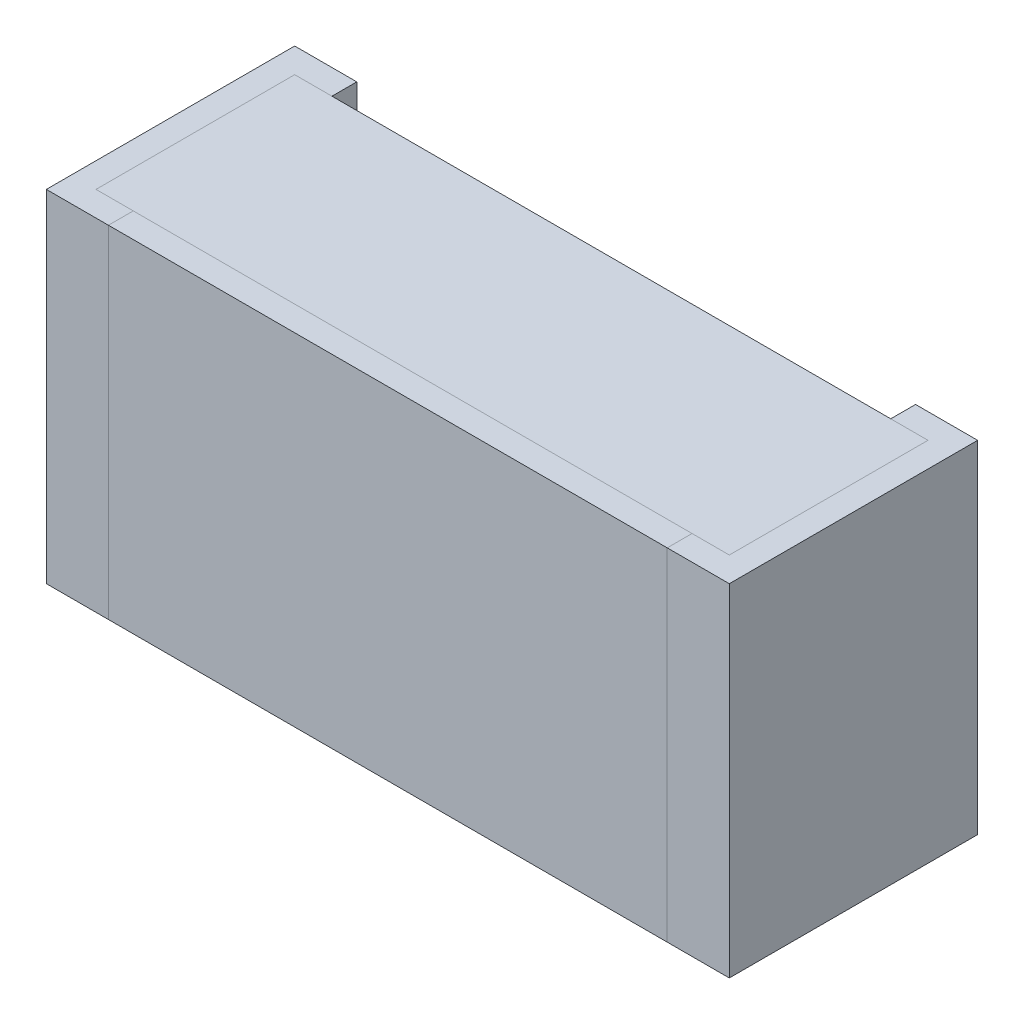
ISO-10303-21;
HEADER;
FILE_DESCRIPTION(('STEP AP214'),'2;1');
FILE_NAME('part.step','',(''),(''),'','','');
FILE_SCHEMA(('AUTOMOTIVE_DESIGN { 1 0 10303 214 1 1 1 1 }'));
ENDSEC;
DATA;
#1=APPLICATION_CONTEXT('core data for automotive mechanical design processes');
#2=APPLICATION_PROTOCOL_DEFINITION('international standard','automotive_design',2000,#1);
#3=PRODUCT_CONTEXT('',#1,'mechanical');
#4=PRODUCT('Part','Part','',(#3));
#5=PRODUCT_RELATED_PRODUCT_CATEGORY('part','',(#4));
#6=PRODUCT_DEFINITION_FORMATION('','',#4);
#7=PRODUCT_DEFINITION_CONTEXT('part definition',#1,'design');
#8=PRODUCT_DEFINITION('design','',#6,#7);
#9=PRODUCT_DEFINITION_SHAPE('','',#8);
#10=(LENGTH_UNIT() NAMED_UNIT(*) SI_UNIT(.MILLI.,.METRE.));
#11=(NAMED_UNIT(*) PLANE_ANGLE_UNIT() SI_UNIT($,.RADIAN.));
#12=(NAMED_UNIT(*) SI_UNIT($,.STERADIAN.) SOLID_ANGLE_UNIT());
#13=UNCERTAINTY_MEASURE_WITH_UNIT(LENGTH_MEASURE(1.E-05),#10,'distance_accuracy_value','');
#14=(GEOMETRIC_REPRESENTATION_CONTEXT(3) GLOBAL_UNCERTAINTY_ASSIGNED_CONTEXT((#13)) GLOBAL_UNIT_ASSIGNED_CONTEXT((#10,
#11,#12)) REPRESENTATION_CONTEXT('',''));
#15=CARTESIAN_POINT('',(0.,0.,0.));
#16=DIRECTION('',(0.,0.,1.));
#17=DIRECTION('',(1.,0.,0.));
#18=AXIS2_PLACEMENT_3D('',#15,#16,#17);
#19=CARTESIAN_POINT('',(-0.51,-0.275,0.04));
#20=DIRECTION('',(1.,0.,0.));
#21=DIRECTION('',(0.,0.,1.));
#22=AXIS2_PLACEMENT_3D('',#19,#20,#21);
#23=PLANE('',#22);
#24=DIRECTION('',(0.,1.,0.));
#25=VECTOR('',#24,1.);
#26=CARTESIAN_POINT('',(-0.51,-0.275,0.36));
#27=LINE('',#26,#25);
#28=CARTESIAN_POINT('',(-0.51,-0.275,0.36));
#29=VERTEX_POINT('',#28);
#30=CARTESIAN_POINT('',(-0.51,0.275,0.36));
#31=VERTEX_POINT('',#30);
#32=EDGE_CURVE('P0_E11',#29,#31,#27,.T.);
#33=ORIENTED_EDGE('',*,*,#32,.T.);
#34=DIRECTION('',(0.,0.,1.));
#35=VECTOR('',#34,1.);
#36=CARTESIAN_POINT('',(-0.51,0.275,0.04));
#37=LINE('',#36,#35);
#38=CARTESIAN_POINT('',(-0.51,0.275,0.04));
#39=VERTEX_POINT('',#38);
#40=EDGE_CURVE('P0_E23',#39,#31,#37,.T.);
#41=ORIENTED_EDGE('',*,*,#40,.F.);
#42=DIRECTION('',(0.,1.,0.));
#43=VECTOR('',#42,1.);
#44=CARTESIAN_POINT('',(-0.51,-0.275,0.04));
#45=LINE('',#44,#43);
#46=CARTESIAN_POINT('',(-0.51,-0.275,0.04));
#47=VERTEX_POINT('',#46);
#48=EDGE_CURVE('P0_E85',#47,#39,#45,.T.);
#49=ORIENTED_EDGE('',*,*,#48,.F.);
#50=DIRECTION('',(0.,0.,1.));
#51=VECTOR('',#50,1.);
#52=CARTESIAN_POINT('',(-0.51,-0.275,0.04));
#53=LINE('',#52,#51);
#54=EDGE_CURVE('P0_E35',#47,#29,#53,.T.);
#55=ORIENTED_EDGE('',*,*,#54,.T.);
#56=EDGE_LOOP('',(#33,#41,#49,#55));
#57=FACE_BOUND('',#56,.T.);
#58=ADVANCED_FACE('P0_F16',(#57),#23,.F.);
#59=CARTESIAN_POINT('',(0.51,-0.275,0.04));
#60=DIRECTION('',(1.,0.,0.));
#61=DIRECTION('',(0.,0.,1.));
#62=AXIS2_PLACEMENT_3D('',#59,#60,#61);
#63=PLANE('',#62);
#64=DIRECTION('',(0.,0.,1.));
#65=VECTOR('',#64,1.);
#66=CARTESIAN_POINT('',(0.51,-0.275,0.04));
#67=LINE('',#66,#65);
#68=CARTESIAN_POINT('',(0.51,-0.275,0.04));
#69=VERTEX_POINT('',#68);
#70=CARTESIAN_POINT('',(0.51,-0.275,0.36));
#71=VERTEX_POINT('',#70);
#72=EDGE_CURVE('P0_E82',#69,#71,#67,.T.);
#73=ORIENTED_EDGE('',*,*,#72,.F.);
#74=DIRECTION('',(0.,1.,0.));
#75=VECTOR('',#74,1.);
#76=CARTESIAN_POINT('',(0.51,-0.275,0.04));
#77=LINE('',#76,#75);
#78=CARTESIAN_POINT('',(0.51,0.275,0.04));
#79=VERTEX_POINT('',#78);
#80=EDGE_CURVE('P0_E62',#69,#79,#77,.T.);
#81=ORIENTED_EDGE('',*,*,#80,.T.);
#82=DIRECTION('',(0.,0.,1.));
#83=VECTOR('',#82,1.);
#84=CARTESIAN_POINT('',(0.51,0.275,0.04));
#85=LINE('',#84,#83);
#86=CARTESIAN_POINT('',(0.51,0.275,0.36));
#87=VERTEX_POINT('',#86);
#88=EDGE_CURVE('P0_E56',#79,#87,#85,.T.);
#89=ORIENTED_EDGE('',*,*,#88,.T.);
#90=DIRECTION('',(0.,1.,0.));
#91=VECTOR('',#90,1.);
#92=CARTESIAN_POINT('',(0.51,-0.275,0.36));
#93=LINE('',#92,#91);
#94=EDGE_CURVE('P0_E59',#71,#87,#93,.T.);
#95=ORIENTED_EDGE('',*,*,#94,.F.);
#96=EDGE_LOOP('',(#73,#81,#89,#95));
#97=FACE_BOUND('',#96,.T.);
#98=ADVANCED_FACE('P0_F58',(#97),#63,.T.);
#99=CARTESIAN_POINT('',(-0.51,-0.275,0.04));
#100=DIRECTION('',(0.,1.,0.));
#101=DIRECTION('',(0.,0.,1.));
#102=AXIS2_PLACEMENT_3D('',#99,#100,#101);
#103=PLANE('',#102);
#104=ORIENTED_EDGE('',*,*,#72,.T.);
#105=DIRECTION('',(1.,0.,0.));
#106=VECTOR('',#105,1.);
#107=CARTESIAN_POINT('',(-0.51,-0.275,0.36));
#108=LINE('',#107,#106);
#109=EDGE_CURVE('P0_E70',#29,#71,#108,.T.);
#110=ORIENTED_EDGE('',*,*,#109,.F.);
#111=ORIENTED_EDGE('',*,*,#54,.F.);
#112=DIRECTION('',(1.,0.,0.));
#113=VECTOR('',#112,1.);
#114=CARTESIAN_POINT('',(-0.51,-0.275,0.04));
#115=LINE('',#114,#113);
#116=EDGE_CURVE('P0_E75',#47,#69,#115,.T.);
#117=ORIENTED_EDGE('',*,*,#116,.T.);
#118=EDGE_LOOP('',(#104,#110,#111,#117));
#119=FACE_BOUND('',#118,.T.);
#120=ADVANCED_FACE('P0_F90',(#119),#103,.F.);
#121=CARTESIAN_POINT('',(-0.51,0.275,0.04));
#122=DIRECTION('',(0.,1.,0.));
#123=DIRECTION('',(0.,0.,1.));
#124=AXIS2_PLACEMENT_3D('',#121,#122,#123);
#125=PLANE('',#124);
#126=DIRECTION('',(1.,0.,0.));
#127=VECTOR('',#126,1.);
#128=CARTESIAN_POINT('',(-0.51,0.275,0.04));
#129=LINE('',#128,#127);
#130=EDGE_CURVE('P0_E73',#39,#79,#129,.T.);
#131=ORIENTED_EDGE('',*,*,#130,.F.);
#132=ORIENTED_EDGE('',*,*,#40,.T.);
#133=DIRECTION('',(1.,0.,0.));
#134=VECTOR('',#133,1.);
#135=CARTESIAN_POINT('',(-0.51,0.275,0.36));
#136=LINE('',#135,#134);
#137=EDGE_CURVE('P0_E68',#31,#87,#136,.T.);
#138=ORIENTED_EDGE('',*,*,#137,.T.);
#139=ORIENTED_EDGE('',*,*,#88,.F.);
#140=EDGE_LOOP('',(#131,#132,#138,#139));
#141=FACE_BOUND('',#140,.T.);
#142=ADVANCED_FACE('P0_F72',(#141),#125,.T.);
#143=CARTESIAN_POINT('',(-0.51,-0.275,0.04));
#144=DIRECTION('',(0.,0.,1.));
#145=DIRECTION('',(1.,0.,0.));
#146=AXIS2_PLACEMENT_3D('',#143,#144,#145);
#147=PLANE('',#146);
#148=ORIENTED_EDGE('',*,*,#130,.T.);
#149=ORIENTED_EDGE('',*,*,#80,.F.);
#150=ORIENTED_EDGE('',*,*,#116,.F.);
#151=ORIENTED_EDGE('',*,*,#48,.T.);
#152=EDGE_LOOP('',(#148,#149,#150,#151));
#153=FACE_BOUND('',#152,.T.);
#154=ADVANCED_FACE('P0_F88',(#153),#147,.F.);
#155=CARTESIAN_POINT('',(-0.51,-0.275,0.36));
#156=DIRECTION('',(0.,0.,1.));
#157=DIRECTION('',(1.,0.,0.));
#158=AXIS2_PLACEMENT_3D('',#155,#156,#157);
#159=PLANE('',#158);
#160=ORIENTED_EDGE('',*,*,#32,.F.);
#161=ORIENTED_EDGE('',*,*,#109,.T.);
#162=ORIENTED_EDGE('',*,*,#94,.T.);
#163=ORIENTED_EDGE('',*,*,#137,.F.);
#164=EDGE_LOOP('',(#160,#161,#162,#163));
#165=FACE_BOUND('',#164,.T.);
#166=ADVANCED_FACE('P0_F67',(#165),#159,.T.);
#167=CLOSED_SHELL('',(#58,#98,#120,#142,#154,#166));
#168=MANIFOLD_SOLID_BREP('P0_B1',#167);
#169=CARTESIAN_POINT('',(-0.55,-0.275,0.));
#170=DIRECTION('',(1.,0.,0.));
#171=DIRECTION('',(0.,0.,1.));
#172=AXIS2_PLACEMENT_3D('',#169,#170,#171);
#173=PLANE('',#172);
#174=DIRECTION('',(0.,1.,0.));
#175=VECTOR('',#174,1.);
#176=CARTESIAN_POINT('',(-0.55,-0.275,0.4));
#177=LINE('',#176,#175);
#178=CARTESIAN_POINT('',(-0.55,-0.275,0.4));
#179=VERTEX_POINT('',#178);
#180=CARTESIAN_POINT('',(-0.55,0.275,0.4));
#181=VERTEX_POINT('',#180);
#182=EDGE_CURVE('P1_E11',#179,#181,#177,.T.);
#183=ORIENTED_EDGE('',*,*,#182,.T.);
#184=DIRECTION('',(0.,0.,1.));
#185=VECTOR('',#184,1.);
#186=CARTESIAN_POINT('',(-0.55,0.275,0.));
#187=LINE('',#186,#185);
#188=CARTESIAN_POINT('',(-0.55,0.275,0.));
#189=VERTEX_POINT('',#188);
#190=EDGE_CURVE('P1_E23',#189,#181,#187,.T.);
#191=ORIENTED_EDGE('',*,*,#190,.F.);
#192=DIRECTION('',(0.,1.,0.));
#193=VECTOR('',#192,1.);
#194=CARTESIAN_POINT('',(-0.55,-0.275,0.));
#195=LINE('',#194,#193);
#196=CARTESIAN_POINT('',(-0.55,-0.275,0.));
#197=VERTEX_POINT('',#196);
#198=EDGE_CURVE('P1_E143',#197,#189,#195,.T.);
#199=ORIENTED_EDGE('',*,*,#198,.F.);
#200=DIRECTION('',(0.,0.,1.));
#201=VECTOR('',#200,1.);
#202=CARTESIAN_POINT('',(-0.55,-0.275,0.));
#203=LINE('',#202,#201);
#204=EDGE_CURVE('P1_E35',#197,#179,#203,.T.);
#205=ORIENTED_EDGE('',*,*,#204,.T.);
#206=EDGE_LOOP('',(#183,#191,#199,#205));
#207=FACE_BOUND('',#206,.T.);
#208=ADVANCED_FACE('P1_F16',(#207),#173,.F.);
#209=CARTESIAN_POINT('',(-0.55,-0.275,0.));
#210=DIRECTION('',(0.,1.,0.));
#211=DIRECTION('',(0.,0.,1.));
#212=AXIS2_PLACEMENT_3D('',#209,#210,#211);
#213=PLANE('',#212);
#214=DIRECTION('',(1.,0.,0.));
#215=VECTOR('',#214,1.);
#216=CARTESIAN_POINT('',(-0.51,-0.275,0.04));
#217=LINE('',#216,#215);
#218=CARTESIAN_POINT('',(-0.51,-0.275,0.04));
#219=VERTEX_POINT('',#218);
#220=CARTESIAN_POINT('',(-0.45,-0.275,0.04));
#221=VERTEX_POINT('',#220);
#222=EDGE_CURVE('P1_E140',#219,#221,#217,.T.);
#223=ORIENTED_EDGE('',*,*,#222,.F.);
#224=DIRECTION('',(0.,0.,1.));
#225=VECTOR('',#224,1.);
#226=CARTESIAN_POINT('',(-0.51,-0.275,0.04));
#227=LINE('',#226,#225);
#228=CARTESIAN_POINT('',(-0.51,-0.275,0.36));
#229=VERTEX_POINT('',#228);
#230=EDGE_CURVE('P1_E102',#219,#229,#227,.T.);
#231=ORIENTED_EDGE('',*,*,#230,.T.);
#232=DIRECTION('',(1.,0.,0.));
#233=VECTOR('',#232,1.);
#234=CARTESIAN_POINT('',(-0.51,-0.275,0.36));
#235=LINE('',#234,#233);
#236=CARTESIAN_POINT('',(-0.45,-0.275,0.36));
#237=VERTEX_POINT('',#236);
#238=EDGE_CURVE('P1_E136',#229,#237,#235,.T.);
#239=ORIENTED_EDGE('',*,*,#238,.T.);
#240=DIRECTION('',(0.,0.,1.));
#241=VECTOR('',#240,1.);
#242=CARTESIAN_POINT('',(-0.45,-0.275,0.));
#243=LINE('',#242,#241);
#244=CARTESIAN_POINT('',(-0.45,-0.275,0.4));
#245=VERTEX_POINT('',#244);
#246=EDGE_CURVE('P1_E133',#237,#245,#243,.T.);
#247=ORIENTED_EDGE('',*,*,#246,.T.);
#248=DIRECTION('',(1.,0.,0.));
#249=VECTOR('',#248,1.);
#250=CARTESIAN_POINT('',(-0.55,-0.275,0.4));
#251=LINE('',#250,#249);
#252=EDGE_CURVE('P1_E131',#179,#245,#251,.T.);
#253=ORIENTED_EDGE('',*,*,#252,.F.);
#254=ORIENTED_EDGE('',*,*,#204,.F.);
#255=DIRECTION('',(1.,0.,0.));
#256=VECTOR('',#255,1.);
#257=CARTESIAN_POINT('',(-0.55,-0.275,0.));
#258=LINE('',#257,#256);
#259=CARTESIAN_POINT('',(-0.45,-0.275,0.));
#260=VERTEX_POINT('',#259);
#261=EDGE_CURVE('P1_E128',#197,#260,#258,.T.);
#262=ORIENTED_EDGE('',*,*,#261,.T.);
#263=DIRECTION('',(0.,0.,1.));
#264=VECTOR('',#263,1.);
#265=CARTESIAN_POINT('',(-0.45,-0.275,0.));
#266=LINE('',#265,#264);
#267=EDGE_CURVE('P1_E126',#260,#221,#266,.T.);
#268=ORIENTED_EDGE('',*,*,#267,.T.);
#269=EDGE_LOOP('',(#223,#231,#239,#247,#253,#254,#262,#268));
#270=FACE_BOUND('',#269,.T.);
#271=ADVANCED_FACE('P1_F152',(#270),#213,.F.);
#272=CARTESIAN_POINT('',(-0.55,-0.275,0.4));
#273=DIRECTION('',(0.,0.,1.));
#274=DIRECTION('',(1.,0.,0.));
#275=AXIS2_PLACEMENT_3D('',#272,#273,#274);
#276=PLANE('',#275);
#277=ORIENTED_EDGE('',*,*,#182,.F.);
#278=ORIENTED_EDGE('',*,*,#252,.T.);
#279=DIRECTION('',(0.,1.,0.));
#280=VECTOR('',#279,1.);
#281=CARTESIAN_POINT('',(-0.45,-0.275,0.4));
#282=LINE('',#281,#280);
#283=CARTESIAN_POINT('',(-0.45,0.275,0.4));
#284=VERTEX_POINT('',#283);
#285=EDGE_CURVE('P1_E124',#245,#284,#282,.T.);
#286=ORIENTED_EDGE('',*,*,#285,.T.);
#287=DIRECTION('',(1.,0.,0.));
#288=VECTOR('',#287,1.);
#289=CARTESIAN_POINT('',(-0.55,0.275,0.4));
#290=LINE('',#289,#288);
#291=EDGE_CURVE('P1_E122',#181,#284,#290,.T.);
#292=ORIENTED_EDGE('',*,*,#291,.F.);
#293=EDGE_LOOP('',(#277,#278,#286,#292));
#294=FACE_BOUND('',#293,.T.);
#295=ADVANCED_FACE('P1_F156',(#294),#276,.T.);
#296=CARTESIAN_POINT('',(-0.55,0.275,0.));
#297=DIRECTION('',(0.,1.,0.));
#298=DIRECTION('',(0.,0.,1.));
#299=AXIS2_PLACEMENT_3D('',#296,#297,#298);
#300=PLANE('',#299);
#301=DIRECTION('',(0.,0.,1.));
#302=VECTOR('',#301,1.);
#303=CARTESIAN_POINT('',(-0.45,0.275,0.));
#304=LINE('',#303,#302);
#305=CARTESIAN_POINT('',(-0.45,0.275,0.));
#306=VERTEX_POINT('',#305);
#307=CARTESIAN_POINT('',(-0.45,0.275,0.04));
#308=VERTEX_POINT('',#307);
#309=EDGE_CURVE('P1_E120',#306,#308,#304,.T.);
#310=ORIENTED_EDGE('',*,*,#309,.F.);
#311=DIRECTION('',(1.,0.,0.));
#312=VECTOR('',#311,1.);
#313=CARTESIAN_POINT('',(-0.55,0.275,0.));
#314=LINE('',#313,#312);
#315=EDGE_CURVE('P1_E117',#189,#306,#314,.T.);
#316=ORIENTED_EDGE('',*,*,#315,.F.);
#317=ORIENTED_EDGE('',*,*,#190,.T.);
#318=ORIENTED_EDGE('',*,*,#291,.T.);
#319=DIRECTION('',(0.,0.,1.));
#320=VECTOR('',#319,1.);
#321=CARTESIAN_POINT('',(-0.45,0.275,0.));
#322=LINE('',#321,#320);
#323=CARTESIAN_POINT('',(-0.45,0.275,0.36));
#324=VERTEX_POINT('',#323);
#325=EDGE_CURVE('P1_E114',#324,#284,#322,.T.);
#326=ORIENTED_EDGE('',*,*,#325,.F.);
#327=DIRECTION('',(1.,0.,0.));
#328=VECTOR('',#327,1.);
#329=CARTESIAN_POINT('',(-0.51,0.275,0.36));
#330=LINE('',#329,#328);
#331=CARTESIAN_POINT('',(-0.51,0.275,0.36));
#332=VERTEX_POINT('',#331);
#333=EDGE_CURVE('P1_E85',#332,#324,#330,.T.);
#334=ORIENTED_EDGE('',*,*,#333,.F.);
#335=DIRECTION('',(0.,0.,1.));
#336=VECTOR('',#335,1.);
#337=CARTESIAN_POINT('',(-0.51,0.275,0.04));
#338=LINE('',#337,#336);
#339=CARTESIAN_POINT('',(-0.51,0.275,0.04));
#340=VERTEX_POINT('',#339);
#341=EDGE_CURVE('P1_E79',#340,#332,#338,.T.);
#342=ORIENTED_EDGE('',*,*,#341,.F.);
#343=DIRECTION('',(1.,0.,0.));
#344=VECTOR('',#343,1.);
#345=CARTESIAN_POINT('',(-0.51,0.275,0.04));
#346=LINE('',#345,#344);
#347=EDGE_CURVE('P1_E82',#340,#308,#346,.T.);
#348=ORIENTED_EDGE('',*,*,#347,.T.);
#349=EDGE_LOOP('',(#310,#316,#317,#318,#326,#334,#342,#348));
#350=FACE_BOUND('',#349,.T.);
#351=ADVANCED_FACE('P1_F81',(#350),#300,.T.);
#352=CARTESIAN_POINT('',(-0.55,-0.275,0.));
#353=DIRECTION('',(0.,0.,1.));
#354=DIRECTION('',(1.,0.,0.));
#355=AXIS2_PLACEMENT_3D('',#352,#353,#354);
#356=PLANE('',#355);
#357=ORIENTED_EDGE('',*,*,#315,.T.);
#358=DIRECTION('',(0.,1.,0.));
#359=VECTOR('',#358,1.);
#360=CARTESIAN_POINT('',(-0.45,-0.275,0.));
#361=LINE('',#360,#359);
#362=EDGE_CURVE('P1_E98',#260,#306,#361,.T.);
#363=ORIENTED_EDGE('',*,*,#362,.F.);
#364=ORIENTED_EDGE('',*,*,#261,.F.);
#365=ORIENTED_EDGE('',*,*,#198,.T.);
#366=EDGE_LOOP('',(#357,#363,#364,#365));
#367=FACE_BOUND('',#366,.T.);
#368=ADVANCED_FACE('P1_F146',(#367),#356,.F.);
#369=CARTESIAN_POINT('',(-0.45,-0.275,0.));
#370=DIRECTION('',(1.,0.,0.));
#371=DIRECTION('',(0.,0.,1.));
#372=AXIS2_PLACEMENT_3D('',#369,#370,#371);
#373=PLANE('',#372);
#374=ORIENTED_EDGE('',*,*,#267,.F.);
#375=ORIENTED_EDGE('',*,*,#362,.T.);
#376=ORIENTED_EDGE('',*,*,#309,.T.);
#377=DIRECTION('',(0.,-1.,0.));
#378=VECTOR('',#377,1.);
#379=CARTESIAN_POINT('',(-0.45,-0.275,0.04));
#380=LINE('',#379,#378);
#381=EDGE_CURVE('P1_E97',#308,#221,#380,.T.);
#382=ORIENTED_EDGE('',*,*,#381,.T.);
#383=EDGE_LOOP('',(#374,#375,#376,#382));
#384=FACE_BOUND('',#383,.T.);
#385=ADVANCED_FACE('P1_F150',(#384),#373,.T.);
#386=CARTESIAN_POINT('',(-0.51,-0.275,0.04));
#387=DIRECTION('',(0.,0.,1.));
#388=DIRECTION('',(1.,0.,0.));
#389=AXIS2_PLACEMENT_3D('',#386,#387,#388);
#390=PLANE('',#389);
#391=ORIENTED_EDGE('',*,*,#347,.F.);
#392=DIRECTION('',(0.,1.,0.));
#393=VECTOR('',#392,1.);
#394=CARTESIAN_POINT('',(-0.51,-0.275,0.04));
#395=LINE('',#394,#393);
#396=EDGE_CURVE('P1_E95',#219,#340,#395,.T.);
#397=ORIENTED_EDGE('',*,*,#396,.F.);
#398=ORIENTED_EDGE('',*,*,#222,.T.);
#399=ORIENTED_EDGE('',*,*,#381,.F.);
#400=EDGE_LOOP('',(#391,#397,#398,#399));
#401=FACE_BOUND('',#400,.T.);
#402=ADVANCED_FACE('P1_F93',(#401),#390,.T.);
#403=CARTESIAN_POINT('',(-0.51,-0.275,0.04));
#404=DIRECTION('',(1.,0.,0.));
#405=DIRECTION('',(0.,0.,1.));
#406=AXIS2_PLACEMENT_3D('',#403,#404,#405);
#407=PLANE('',#406);
#408=ORIENTED_EDGE('',*,*,#230,.F.);
#409=ORIENTED_EDGE('',*,*,#396,.T.);
#410=ORIENTED_EDGE('',*,*,#341,.T.);
#411=DIRECTION('',(0.,1.,0.));
#412=VECTOR('',#411,1.);
#413=CARTESIAN_POINT('',(-0.51,-0.275,0.36));
#414=LINE('',#413,#412);
#415=EDGE_CURVE('P1_E104',#229,#332,#414,.T.);
#416=ORIENTED_EDGE('',*,*,#415,.F.);
#417=EDGE_LOOP('',(#408,#409,#410,#416));
#418=FACE_BOUND('',#417,.T.);
#419=ADVANCED_FACE('P1_F100',(#418),#407,.T.);
#420=CARTESIAN_POINT('',(-0.51,-0.275,0.36));
#421=DIRECTION('',(0.,0.,1.));
#422=DIRECTION('',(1.,0.,0.));
#423=AXIS2_PLACEMENT_3D('',#420,#421,#422);
#424=PLANE('',#423);
#425=DIRECTION('',(0.,-1.,0.));
#426=VECTOR('',#425,1.);
#427=CARTESIAN_POINT('',(-0.45,-0.275,0.36));
#428=LINE('',#427,#426);
#429=EDGE_CURVE('P1_E107',#324,#237,#428,.T.);
#430=ORIENTED_EDGE('',*,*,#429,.T.);
#431=ORIENTED_EDGE('',*,*,#238,.F.);
#432=ORIENTED_EDGE('',*,*,#415,.T.);
#433=ORIENTED_EDGE('',*,*,#333,.T.);
#434=EDGE_LOOP('',(#430,#431,#432,#433));
#435=FACE_BOUND('',#434,.T.);
#436=ADVANCED_FACE('P1_F162',(#435),#424,.F.);
#437=CARTESIAN_POINT('',(-0.45,-0.275,0.));
#438=DIRECTION('',(1.,0.,0.));
#439=DIRECTION('',(0.,0.,1.));
#440=AXIS2_PLACEMENT_3D('',#437,#438,#439);
#441=PLANE('',#440);
#442=ORIENTED_EDGE('',*,*,#246,.F.);
#443=ORIENTED_EDGE('',*,*,#429,.F.);
#444=ORIENTED_EDGE('',*,*,#325,.T.);
#445=ORIENTED_EDGE('',*,*,#285,.F.);
#446=EDGE_LOOP('',(#442,#443,#444,#445));
#447=FACE_BOUND('',#446,.T.);
#448=ADVANCED_FACE('P1_F159',(#447),#441,.T.);
#449=CLOSED_SHELL('',(#208,#271,#295,#351,#368,#385,#402,#419,#436,#448));
#450=MANIFOLD_SOLID_BREP('P1_B1',#449);
#451=CARTESIAN_POINT('',(0.55,0.275,0.));
#452=DIRECTION('',(-1.,0.,0.));
#453=DIRECTION('',(0.,0.,1.));
#454=AXIS2_PLACEMENT_3D('',#451,#452,#453);
#455=PLANE('',#454);
#456=DIRECTION('',(0.,-1.,0.));
#457=VECTOR('',#456,1.);
#458=CARTESIAN_POINT('',(0.55,0.275,0.4));
#459=LINE('',#458,#457);
#460=CARTESIAN_POINT('',(0.55,0.275,0.4));
#461=VERTEX_POINT('',#460);
#462=CARTESIAN_POINT('',(0.55,-0.275,0.4));
#463=VERTEX_POINT('',#462);
#464=EDGE_CURVE('P2_E11',#461,#463,#459,.T.);
#465=ORIENTED_EDGE('',*,*,#464,.T.);
#466=DIRECTION('',(0.,0.,1.));
#467=VECTOR('',#466,1.);
#468=CARTESIAN_POINT('',(0.55,-0.275,0.));
#469=LINE('',#468,#467);
#470=CARTESIAN_POINT('',(0.55,-0.275,0.));
#471=VERTEX_POINT('',#470);
#472=EDGE_CURVE('P2_E23',#471,#463,#469,.T.);
#473=ORIENTED_EDGE('',*,*,#472,.F.);
#474=DIRECTION('',(0.,-1.,0.));
#475=VECTOR('',#474,1.);
#476=CARTESIAN_POINT('',(0.55,0.275,0.));
#477=LINE('',#476,#475);
#478=CARTESIAN_POINT('',(0.55,0.275,0.));
#479=VERTEX_POINT('',#478);
#480=EDGE_CURVE('P2_E143',#479,#471,#477,.T.);
#481=ORIENTED_EDGE('',*,*,#480,.F.);
#482=DIRECTION('',(0.,0.,1.));
#483=VECTOR('',#482,1.);
#484=CARTESIAN_POINT('',(0.55,0.275,0.));
#485=LINE('',#484,#483);
#486=EDGE_CURVE('P2_E37',#479,#461,#485,.T.);
#487=ORIENTED_EDGE('',*,*,#486,.T.);
#488=EDGE_LOOP('',(#465,#473,#481,#487));
#489=FACE_BOUND('',#488,.T.);
#490=ADVANCED_FACE('P2_F16',(#489),#455,.F.);
#491=CARTESIAN_POINT('',(0.55,0.275,0.));
#492=DIRECTION('',(0.,-1.,0.));
#493=DIRECTION('',(0.,0.,1.));
#494=AXIS2_PLACEMENT_3D('',#491,#492,#493);
#495=PLANE('',#494);
#496=DIRECTION('',(-1.,0.,0.));
#497=VECTOR('',#496,1.);
#498=CARTESIAN_POINT('',(0.51,0.275,0.04));
#499=LINE('',#498,#497);
#500=CARTESIAN_POINT('',(0.51,0.275,0.04));
#501=VERTEX_POINT('',#500);
#502=CARTESIAN_POINT('',(0.45,0.275,0.04));
#503=VERTEX_POINT('',#502);
#504=EDGE_CURVE('P2_E140',#501,#503,#499,.T.);
#505=ORIENTED_EDGE('',*,*,#504,.F.);
#506=DIRECTION('',(0.,0.,1.));
#507=VECTOR('',#506,1.);
#508=CARTESIAN_POINT('',(0.51,0.275,0.04));
#509=LINE('',#508,#507);
#510=CARTESIAN_POINT('',(0.51,0.275,0.36));
#511=VERTEX_POINT('',#510);
#512=EDGE_CURVE('P2_E103',#501,#511,#509,.T.);
#513=ORIENTED_EDGE('',*,*,#512,.T.);
#514=DIRECTION('',(-1.,0.,0.));
#515=VECTOR('',#514,1.);
#516=CARTESIAN_POINT('',(0.51,0.275,0.36));
#517=LINE('',#516,#515);
#518=CARTESIAN_POINT('',(0.45,0.275,0.36));
#519=VERTEX_POINT('',#518);
#520=EDGE_CURVE('P2_E136',#511,#519,#517,.T.);
#521=ORIENTED_EDGE('',*,*,#520,.T.);
#522=DIRECTION('',(0.,0.,1.));
#523=VECTOR('',#522,1.);
#524=CARTESIAN_POINT('',(0.45,0.275,0.));
#525=LINE('',#524,#523);
#526=CARTESIAN_POINT('',(0.45,0.275,0.4));
#527=VERTEX_POINT('',#526);
#528=EDGE_CURVE('P2_E133',#519,#527,#525,.T.);
#529=ORIENTED_EDGE('',*,*,#528,.T.);
#530=DIRECTION('',(-1.,0.,0.));
#531=VECTOR('',#530,1.);
#532=CARTESIAN_POINT('',(0.55,0.275,0.4));
#533=LINE('',#532,#531);
#534=EDGE_CURVE('P2_E131',#461,#527,#533,.T.);
#535=ORIENTED_EDGE('',*,*,#534,.F.);
#536=ORIENTED_EDGE('',*,*,#486,.F.);
#537=DIRECTION('',(-1.,0.,0.));
#538=VECTOR('',#537,1.);
#539=CARTESIAN_POINT('',(0.55,0.275,0.));
#540=LINE('',#539,#538);
#541=CARTESIAN_POINT('',(0.45,0.275,0.));
#542=VERTEX_POINT('',#541);
#543=EDGE_CURVE('P2_E128',#479,#542,#540,.T.);
#544=ORIENTED_EDGE('',*,*,#543,.T.);
#545=DIRECTION('',(0.,0.,1.));
#546=VECTOR('',#545,1.);
#547=CARTESIAN_POINT('',(0.45,0.275,0.));
#548=LINE('',#547,#546);
#549=EDGE_CURVE('P2_E126',#542,#503,#548,.T.);
#550=ORIENTED_EDGE('',*,*,#549,.T.);
#551=EDGE_LOOP('',(#505,#513,#521,#529,#535,#536,#544,#550));
#552=FACE_BOUND('',#551,.T.);
#553=ADVANCED_FACE('P2_F149',(#552),#495,.F.);
#554=CARTESIAN_POINT('',(0.55,0.275,0.4));
#555=DIRECTION('',(0.,0.,1.));
#556=DIRECTION('',(-1.,0.,0.));
#557=AXIS2_PLACEMENT_3D('',#554,#555,#556);
#558=PLANE('',#557);
#559=ORIENTED_EDGE('',*,*,#464,.F.);
#560=ORIENTED_EDGE('',*,*,#534,.T.);
#561=DIRECTION('',(0.,-1.,0.));
#562=VECTOR('',#561,1.);
#563=CARTESIAN_POINT('',(0.45,0.275,0.4));
#564=LINE('',#563,#562);
#565=CARTESIAN_POINT('',(0.45,-0.275,0.4));
#566=VERTEX_POINT('',#565);
#567=EDGE_CURVE('P2_E124',#527,#566,#564,.T.);
#568=ORIENTED_EDGE('',*,*,#567,.T.);
#569=DIRECTION('',(-1.,0.,0.));
#570=VECTOR('',#569,1.);
#571=CARTESIAN_POINT('',(0.55,-0.275,0.4));
#572=LINE('',#571,#570);
#573=EDGE_CURVE('P2_E30',#463,#566,#572,.T.);
#574=ORIENTED_EDGE('',*,*,#573,.F.);
#575=EDGE_LOOP('',(#559,#560,#568,#574));
#576=FACE_BOUND('',#575,.T.);
#577=ADVANCED_FACE('P2_F147',(#576),#558,.T.);
#578=CARTESIAN_POINT('',(0.55,-0.275,0.));
#579=DIRECTION('',(0.,-1.,0.));
#580=DIRECTION('',(0.,0.,1.));
#581=AXIS2_PLACEMENT_3D('',#578,#579,#580);
#582=PLANE('',#581);
#583=DIRECTION('',(0.,0.,1.));
#584=VECTOR('',#583,1.);
#585=CARTESIAN_POINT('',(0.45,-0.275,0.));
#586=LINE('',#585,#584);
#587=CARTESIAN_POINT('',(0.45,-0.275,0.));
#588=VERTEX_POINT('',#587);
#589=CARTESIAN_POINT('',(0.45,-0.275,0.04));
#590=VERTEX_POINT('',#589);
#591=EDGE_CURVE('P2_E121',#588,#590,#586,.T.);
#592=ORIENTED_EDGE('',*,*,#591,.F.);
#593=DIRECTION('',(-1.,0.,0.));
#594=VECTOR('',#593,1.);
#595=CARTESIAN_POINT('',(0.55,-0.275,0.));
#596=LINE('',#595,#594);
#597=EDGE_CURVE('P2_E118',#471,#588,#596,.T.);
#598=ORIENTED_EDGE('',*,*,#597,.F.);
#599=ORIENTED_EDGE('',*,*,#472,.T.);
#600=ORIENTED_EDGE('',*,*,#573,.T.);
#601=DIRECTION('',(0.,0.,1.));
#602=VECTOR('',#601,1.);
#603=CARTESIAN_POINT('',(0.45,-0.275,0.));
#604=LINE('',#603,#602);
#605=CARTESIAN_POINT('',(0.45,-0.275,0.36));
#606=VERTEX_POINT('',#605);
#607=EDGE_CURVE('P2_E115',#606,#566,#604,.T.);
#608=ORIENTED_EDGE('',*,*,#607,.F.);
#609=DIRECTION('',(-1.,0.,0.));
#610=VECTOR('',#609,1.);
#611=CARTESIAN_POINT('',(0.51,-0.275,0.36));
#612=LINE('',#611,#610);
#613=CARTESIAN_POINT('',(0.51,-0.275,0.36));
#614=VERTEX_POINT('',#613);
#615=EDGE_CURVE('P2_E86',#614,#606,#612,.T.);
#616=ORIENTED_EDGE('',*,*,#615,.F.);
#617=DIRECTION('',(0.,0.,1.));
#618=VECTOR('',#617,1.);
#619=CARTESIAN_POINT('',(0.51,-0.275,0.04));
#620=LINE('',#619,#618);
#621=CARTESIAN_POINT('',(0.51,-0.275,0.04));
#622=VERTEX_POINT('',#621);
#623=EDGE_CURVE('P2_E80',#622,#614,#620,.T.);
#624=ORIENTED_EDGE('',*,*,#623,.F.);
#625=DIRECTION('',(-1.,0.,0.));
#626=VECTOR('',#625,1.);
#627=CARTESIAN_POINT('',(0.51,-0.275,0.04));
#628=LINE('',#627,#626);
#629=EDGE_CURVE('P2_E83',#622,#590,#628,.T.);
#630=ORIENTED_EDGE('',*,*,#629,.T.);
#631=EDGE_LOOP('',(#592,#598,#599,#600,#608,#616,#624,#630));
#632=FACE_BOUND('',#631,.T.);
#633=ADVANCED_FACE('P2_F82',(#632),#582,.T.);
#634=CARTESIAN_POINT('',(0.55,0.275,0.));
#635=DIRECTION('',(0.,0.,1.));
#636=DIRECTION('',(-1.,0.,0.));
#637=AXIS2_PLACEMENT_3D('',#634,#635,#636);
#638=PLANE('',#637);
#639=ORIENTED_EDGE('',*,*,#597,.T.);
#640=DIRECTION('',(0.,-1.,0.));
#641=VECTOR('',#640,1.);
#642=CARTESIAN_POINT('',(0.45,0.275,0.));
#643=LINE('',#642,#641);
#644=EDGE_CURVE('P2_E99',#542,#588,#643,.T.);
#645=ORIENTED_EDGE('',*,*,#644,.F.);
#646=ORIENTED_EDGE('',*,*,#543,.F.);
#647=ORIENTED_EDGE('',*,*,#480,.T.);
#648=EDGE_LOOP('',(#639,#645,#646,#647));
#649=FACE_BOUND('',#648,.T.);
#650=ADVANCED_FACE('P2_F162',(#649),#638,.F.);
#651=CARTESIAN_POINT('',(0.45,0.275,0.));
#652=DIRECTION('',(-1.,0.,0.));
#653=DIRECTION('',(0.,0.,1.));
#654=AXIS2_PLACEMENT_3D('',#651,#652,#653);
#655=PLANE('',#654);
#656=ORIENTED_EDGE('',*,*,#549,.F.);
#657=ORIENTED_EDGE('',*,*,#644,.T.);
#658=ORIENTED_EDGE('',*,*,#591,.T.);
#659=DIRECTION('',(0.,1.,0.));
#660=VECTOR('',#659,1.);
#661=CARTESIAN_POINT('',(0.45,0.275,0.04));
#662=LINE('',#661,#660);
#663=EDGE_CURVE('P2_E98',#590,#503,#662,.T.);
#664=ORIENTED_EDGE('',*,*,#663,.T.);
#665=EDGE_LOOP('',(#656,#657,#658,#664));
#666=FACE_BOUND('',#665,.T.);
#667=ADVANCED_FACE('P2_F160',(#666),#655,.T.);
#668=CARTESIAN_POINT('',(0.51,0.275,0.04));
#669=DIRECTION('',(0.,0.,1.));
#670=DIRECTION('',(-1.,0.,0.));
#671=AXIS2_PLACEMENT_3D('',#668,#669,#670);
#672=PLANE('',#671);
#673=ORIENTED_EDGE('',*,*,#629,.F.);
#674=DIRECTION('',(0.,-1.,0.));
#675=VECTOR('',#674,1.);
#676=CARTESIAN_POINT('',(0.51,0.275,0.04));
#677=LINE('',#676,#675);
#678=EDGE_CURVE('P2_E95',#501,#622,#677,.T.);
#679=ORIENTED_EDGE('',*,*,#678,.F.);
#680=ORIENTED_EDGE('',*,*,#504,.T.);
#681=ORIENTED_EDGE('',*,*,#663,.F.);
#682=EDGE_LOOP('',(#673,#679,#680,#681));
#683=FACE_BOUND('',#682,.T.);
#684=ADVANCED_FACE('P2_F93',(#683),#672,.T.);
#685=CARTESIAN_POINT('',(0.51,0.275,0.04));
#686=DIRECTION('',(-1.,0.,0.));
#687=DIRECTION('',(0.,0.,1.));
#688=AXIS2_PLACEMENT_3D('',#685,#686,#687);
#689=PLANE('',#688);
#690=ORIENTED_EDGE('',*,*,#512,.F.);
#691=ORIENTED_EDGE('',*,*,#678,.T.);
#692=ORIENTED_EDGE('',*,*,#623,.T.);
#693=DIRECTION('',(0.,-1.,0.));
#694=VECTOR('',#693,1.);
#695=CARTESIAN_POINT('',(0.51,0.275,0.36));
#696=LINE('',#695,#694);
#697=EDGE_CURVE('P2_E105',#511,#614,#696,.T.);
#698=ORIENTED_EDGE('',*,*,#697,.F.);
#699=EDGE_LOOP('',(#690,#691,#692,#698));
#700=FACE_BOUND('',#699,.T.);
#701=ADVANCED_FACE('P2_F101',(#700),#689,.T.);
#702=CARTESIAN_POINT('',(0.51,0.275,0.36));
#703=DIRECTION('',(0.,0.,1.));
#704=DIRECTION('',(-1.,0.,0.));
#705=AXIS2_PLACEMENT_3D('',#702,#703,#704);
#706=PLANE('',#705);
#707=DIRECTION('',(0.,1.,0.));
#708=VECTOR('',#707,1.);
#709=CARTESIAN_POINT('',(0.45,0.275,0.36));
#710=LINE('',#709,#708);
#711=EDGE_CURVE('P2_E108',#606,#519,#710,.T.);
#712=ORIENTED_EDGE('',*,*,#711,.T.);
#713=ORIENTED_EDGE('',*,*,#520,.F.);
#714=ORIENTED_EDGE('',*,*,#697,.T.);
#715=ORIENTED_EDGE('',*,*,#615,.T.);
#716=EDGE_LOOP('',(#712,#713,#714,#715));
#717=FACE_BOUND('',#716,.T.);
#718=ADVANCED_FACE('P2_F156',(#717),#706,.F.);
#719=CARTESIAN_POINT('',(0.45,0.275,0.));
#720=DIRECTION('',(-1.,0.,0.));
#721=DIRECTION('',(0.,0.,1.));
#722=AXIS2_PLACEMENT_3D('',#719,#720,#721);
#723=PLANE('',#722);
#724=ORIENTED_EDGE('',*,*,#528,.F.);
#725=ORIENTED_EDGE('',*,*,#711,.F.);
#726=ORIENTED_EDGE('',*,*,#607,.T.);
#727=ORIENTED_EDGE('',*,*,#567,.F.);
#728=EDGE_LOOP('',(#724,#725,#726,#727));
#729=FACE_BOUND('',#728,.T.);
#730=ADVANCED_FACE('P2_F154',(#729),#723,.T.);
#731=CLOSED_SHELL('',(#490,#553,#577,#633,#650,#667,#684,#701,#718,#730));
#732=MANIFOLD_SOLID_BREP('P2_B1',#731);
#733=CARTESIAN_POINT('',(-0.45,-0.275,0.36));
#734=DIRECTION('',(1.,0.,0.));
#735=DIRECTION('',(0.,0.,1.));
#736=AXIS2_PLACEMENT_3D('',#733,#734,#735);
#737=PLANE('',#736);
#738=DIRECTION('',(0.,1.,0.));
#739=VECTOR('',#738,1.);
#740=CARTESIAN_POINT('',(-0.45,-0.275,0.4));
#741=LINE('',#740,#739);
#742=CARTESIAN_POINT('',(-0.45,-0.275,0.4));
#743=VERTEX_POINT('',#742);
#744=CARTESIAN_POINT('',(-0.45,0.275,0.4));
#745=VERTEX_POINT('',#744);
#746=EDGE_CURVE('P3_E11',#743,#745,#741,.T.);
#747=ORIENTED_EDGE('',*,*,#746,.T.);
#748=DIRECTION('',(0.,0.,1.));
#749=VECTOR('',#748,1.);
#750=CARTESIAN_POINT('',(-0.45,0.275,0.36));
#751=LINE('',#750,#749);
#752=CARTESIAN_POINT('',(-0.45,0.275,0.36));
#753=VERTEX_POINT('',#752);
#754=EDGE_CURVE('P3_E23',#753,#745,#751,.T.);
#755=ORIENTED_EDGE('',*,*,#754,.F.);
#756=DIRECTION('',(0.,1.,0.));
#757=VECTOR('',#756,1.);
#758=CARTESIAN_POINT('',(-0.45,-0.275,0.36));
#759=LINE('',#758,#757);
#760=CARTESIAN_POINT('',(-0.45,-0.275,0.36));
#761=VERTEX_POINT('',#760);
#762=EDGE_CURVE('P3_E85',#761,#753,#759,.T.);
#763=ORIENTED_EDGE('',*,*,#762,.F.);
#764=DIRECTION('',(0.,0.,1.));
#765=VECTOR('',#764,1.);
#766=CARTESIAN_POINT('',(-0.45,-0.275,0.36));
#767=LINE('',#766,#765);
#768=EDGE_CURVE('P3_E35',#761,#743,#767,.T.);
#769=ORIENTED_EDGE('',*,*,#768,.T.);
#770=EDGE_LOOP('',(#747,#755,#763,#769));
#771=FACE_BOUND('',#770,.T.);
#772=ADVANCED_FACE('P3_F16',(#771),#737,.F.);
#773=CARTESIAN_POINT('',(0.45,-0.275,0.36));
#774=DIRECTION('',(1.,0.,0.));
#775=DIRECTION('',(0.,0.,1.));
#776=AXIS2_PLACEMENT_3D('',#773,#774,#775);
#777=PLANE('',#776);
#778=DIRECTION('',(0.,0.,1.));
#779=VECTOR('',#778,1.);
#780=CARTESIAN_POINT('',(0.45,-0.275,0.36));
#781=LINE('',#780,#779);
#782=CARTESIAN_POINT('',(0.45,-0.275,0.36));
#783=VERTEX_POINT('',#782);
#784=CARTESIAN_POINT('',(0.45,-0.275,0.4));
#785=VERTEX_POINT('',#784);
#786=EDGE_CURVE('P3_E82',#783,#785,#781,.T.);
#787=ORIENTED_EDGE('',*,*,#786,.F.);
#788=DIRECTION('',(0.,1.,0.));
#789=VECTOR('',#788,1.);
#790=CARTESIAN_POINT('',(0.45,-0.275,0.36));
#791=LINE('',#790,#789);
#792=CARTESIAN_POINT('',(0.45,0.275,0.36));
#793=VERTEX_POINT('',#792);
#794=EDGE_CURVE('P3_E62',#783,#793,#791,.T.);
#795=ORIENTED_EDGE('',*,*,#794,.T.);
#796=DIRECTION('',(0.,0.,1.));
#797=VECTOR('',#796,1.);
#798=CARTESIAN_POINT('',(0.45,0.275,0.36));
#799=LINE('',#798,#797);
#800=CARTESIAN_POINT('',(0.45,0.275,0.4));
#801=VERTEX_POINT('',#800);
#802=EDGE_CURVE('P3_E56',#793,#801,#799,.T.);
#803=ORIENTED_EDGE('',*,*,#802,.T.);
#804=DIRECTION('',(0.,1.,0.));
#805=VECTOR('',#804,1.);
#806=CARTESIAN_POINT('',(0.45,-0.275,0.4));
#807=LINE('',#806,#805);
#808=EDGE_CURVE('P3_E59',#785,#801,#807,.T.);
#809=ORIENTED_EDGE('',*,*,#808,.F.);
#810=EDGE_LOOP('',(#787,#795,#803,#809));
#811=FACE_BOUND('',#810,.T.);
#812=ADVANCED_FACE('P3_F58',(#811),#777,.T.);
#813=CARTESIAN_POINT('',(-0.45,-0.275,0.36));
#814=DIRECTION('',(0.,1.,0.));
#815=DIRECTION('',(0.,0.,1.));
#816=AXIS2_PLACEMENT_3D('',#813,#814,#815);
#817=PLANE('',#816);
#818=ORIENTED_EDGE('',*,*,#786,.T.);
#819=DIRECTION('',(1.,0.,0.));
#820=VECTOR('',#819,1.);
#821=CARTESIAN_POINT('',(-0.45,-0.275,0.4));
#822=LINE('',#821,#820);
#823=EDGE_CURVE('P3_E70',#743,#785,#822,.T.);
#824=ORIENTED_EDGE('',*,*,#823,.F.);
#825=ORIENTED_EDGE('',*,*,#768,.F.);
#826=DIRECTION('',(1.,0.,0.));
#827=VECTOR('',#826,1.);
#828=CARTESIAN_POINT('',(-0.45,-0.275,0.36));
#829=LINE('',#828,#827);
#830=EDGE_CURVE('P3_E75',#761,#783,#829,.T.);
#831=ORIENTED_EDGE('',*,*,#830,.T.);
#832=EDGE_LOOP('',(#818,#824,#825,#831));
#833=FACE_BOUND('',#832,.T.);
#834=ADVANCED_FACE('P3_F90',(#833),#817,.F.);
#835=CARTESIAN_POINT('',(-0.45,0.275,0.36));
#836=DIRECTION('',(0.,1.,0.));
#837=DIRECTION('',(0.,0.,1.));
#838=AXIS2_PLACEMENT_3D('',#835,#836,#837);
#839=PLANE('',#838);
#840=DIRECTION('',(1.,0.,0.));
#841=VECTOR('',#840,1.);
#842=CARTESIAN_POINT('',(-0.45,0.275,0.36));
#843=LINE('',#842,#841);
#844=EDGE_CURVE('P3_E73',#753,#793,#843,.T.);
#845=ORIENTED_EDGE('',*,*,#844,.F.);
#846=ORIENTED_EDGE('',*,*,#754,.T.);
#847=DIRECTION('',(1.,0.,0.));
#848=VECTOR('',#847,1.);
#849=CARTESIAN_POINT('',(-0.45,0.275,0.4));
#850=LINE('',#849,#848);
#851=EDGE_CURVE('P3_E68',#745,#801,#850,.T.);
#852=ORIENTED_EDGE('',*,*,#851,.T.);
#853=ORIENTED_EDGE('',*,*,#802,.F.);
#854=EDGE_LOOP('',(#845,#846,#852,#853));
#855=FACE_BOUND('',#854,.T.);
#856=ADVANCED_FACE('P3_F72',(#855),#839,.T.);
#857=CARTESIAN_POINT('',(-0.45,-0.275,0.36));
#858=DIRECTION('',(0.,0.,1.));
#859=DIRECTION('',(1.,0.,0.));
#860=AXIS2_PLACEMENT_3D('',#857,#858,#859);
#861=PLANE('',#860);
#862=ORIENTED_EDGE('',*,*,#844,.T.);
#863=ORIENTED_EDGE('',*,*,#794,.F.);
#864=ORIENTED_EDGE('',*,*,#830,.F.);
#865=ORIENTED_EDGE('',*,*,#762,.T.);
#866=EDGE_LOOP('',(#862,#863,#864,#865));
#867=FACE_BOUND('',#866,.T.);
#868=ADVANCED_FACE('P3_F88',(#867),#861,.F.);
#869=CARTESIAN_POINT('',(-0.45,-0.275,0.4));
#870=DIRECTION('',(0.,0.,1.));
#871=DIRECTION('',(1.,0.,0.));
#872=AXIS2_PLACEMENT_3D('',#869,#870,#871);
#873=PLANE('',#872);
#874=ORIENTED_EDGE('',*,*,#746,.F.);
#875=ORIENTED_EDGE('',*,*,#823,.T.);
#876=ORIENTED_EDGE('',*,*,#808,.T.);
#877=ORIENTED_EDGE('',*,*,#851,.F.);
#878=EDGE_LOOP('',(#874,#875,#876,#877));
#879=FACE_BOUND('',#878,.T.);
#880=ADVANCED_FACE('P3_F67',(#879),#873,.T.);
#881=CLOSED_SHELL('',(#772,#812,#834,#856,#868,#880));
#882=MANIFOLD_SOLID_BREP('P3_B1',#881);
#883=ADVANCED_BREP_SHAPE_REPRESENTATION('',(#18,#168,#450,#732,#882),#14);
#884=SHAPE_DEFINITION_REPRESENTATION(#9,#883);
ENDSEC;
END-ISO-10303-21;
